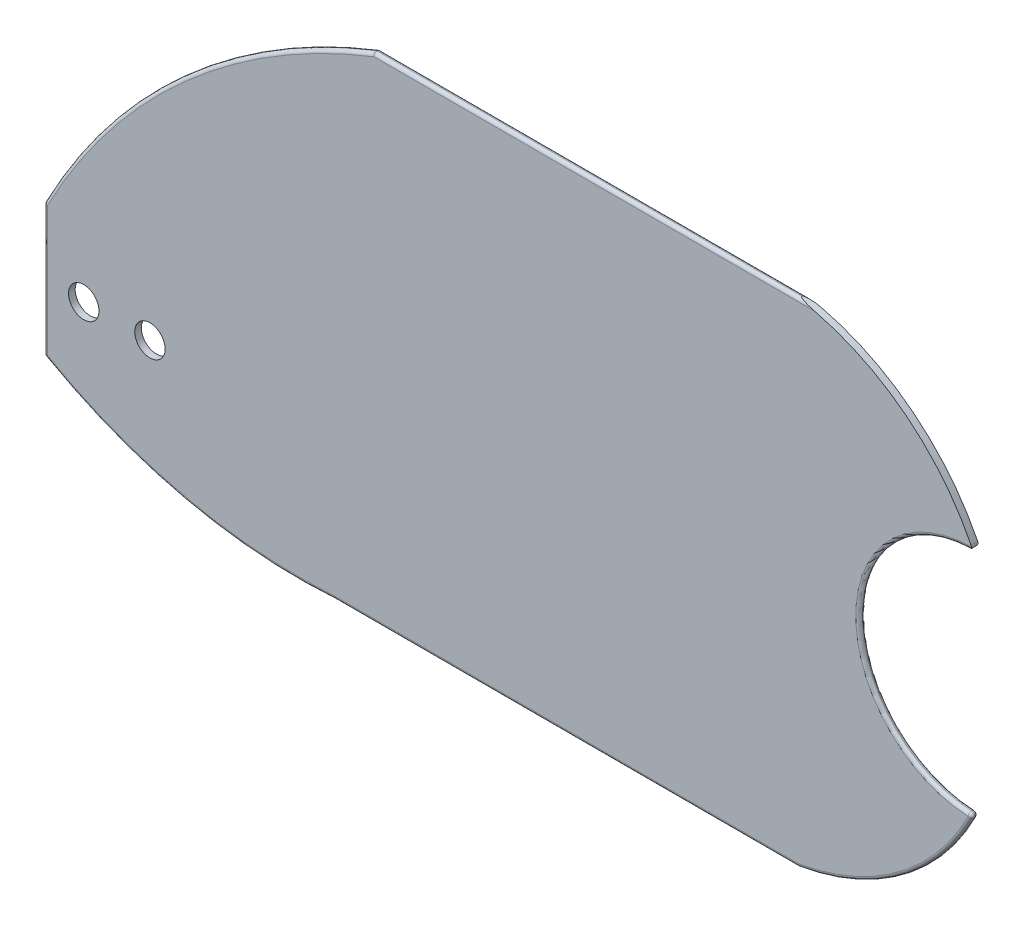
ISO-10303-21;
HEADER;
FILE_DESCRIPTION(('STEP AP214'),'2;1');
FILE_NAME('part.step','',(''),(''),'','','');
FILE_SCHEMA(('AUTOMOTIVE_DESIGN { 1 0 10303 214 1 1 1 1 }'));
ENDSEC;
DATA;
#1=APPLICATION_CONTEXT('core data for automotive mechanical design processes');
#2=APPLICATION_PROTOCOL_DEFINITION('international standard','automotive_design',2000,#1);
#3=PRODUCT_CONTEXT('',#1,'mechanical');
#4=PRODUCT('Part','Part','',(#3));
#5=PRODUCT_RELATED_PRODUCT_CATEGORY('part','',(#4));
#6=PRODUCT_DEFINITION_FORMATION('','',#4);
#7=PRODUCT_DEFINITION_CONTEXT('part definition',#1,'design');
#8=PRODUCT_DEFINITION('design','',#6,#7);
#9=PRODUCT_DEFINITION_SHAPE('','',#8);
#10=(LENGTH_UNIT() NAMED_UNIT(*) SI_UNIT(.MILLI.,.METRE.));
#11=(NAMED_UNIT(*) PLANE_ANGLE_UNIT() SI_UNIT($,.RADIAN.));
#12=(NAMED_UNIT(*) SI_UNIT($,.STERADIAN.) SOLID_ANGLE_UNIT());
#13=UNCERTAINTY_MEASURE_WITH_UNIT(LENGTH_MEASURE(1.E-05),#10,'distance_accuracy_value','');
#14=(GEOMETRIC_REPRESENTATION_CONTEXT(3) GLOBAL_UNCERTAINTY_ASSIGNED_CONTEXT((#13)) GLOBAL_UNIT_ASSIGNED_CONTEXT((#10,
#11,#12)) REPRESENTATION_CONTEXT('',''));
#15=CARTESIAN_POINT('',(0.,0.,0.));
#16=DIRECTION('',(0.,0.,1.));
#17=DIRECTION('',(1.,0.,0.));
#18=AXIS2_PLACEMENT_3D('',#15,#16,#17);
#19=CARTESIAN_POINT('',(385.634627392656,55.1747110336501,0.5));
#20=DIRECTION('',(0.,0.,-1.));
#21=DIRECTION('',(-1.,0.,0.));
#22=AXIS2_PLACEMENT_3D('',#19,#20,#21);
#23=CYLINDRICAL_SURFACE('',#22,17.9547618473941);
#24=DIRECTION('',(0.,0.,-1.));
#25=VECTOR('',#24,1.);
#26=CARTESIAN_POINT('',(388.656714197244,72.8733116659648,0.5));
#27=LINE('',#26,#25);
#28=CARTESIAN_POINT('',(388.656714197244,72.8733116659648,0.207920817465054));
#29=VERTEX_POINT('',#28);
#30=CARTESIAN_POINT('',(388.656714197244,72.8733116659648,0.292079182534946));
#31=VERTEX_POINT('',#30);
#32=EDGE_CURVE('E233',#29,#31,#27,.F.);
#33=ORIENTED_EDGE('',*,*,#32,.T.);
#34=CARTESIAN_POINT('',(388.656714197244,72.8733116659648,0.292079182534946));
#35=CARTESIAN_POINT('',(388.66305889166,72.8722285705896,0.298301009718315));
#36=CARTESIAN_POINT('',(388.669910667787,72.8710548469745,0.303879054300855));
#37=CARTESIAN_POINT('',(388.684225081437,72.8685934937381,0.31405916971495));
#38=CARTESIAN_POINT('',(388.691683133368,72.8673067141445,0.318667765769108));
#39=CARTESIAN_POINT('',(388.714373271092,72.8633761726897,0.331531594027607));
#40=CARTESIAN_POINT('',(388.730052555621,72.8606398624957,0.338927635021274));
#41=CARTESIAN_POINT('',(388.776533677661,72.8524614139527,0.358683280167489));
#42=CARTESIAN_POINT('',(388.807986912445,72.8468442988038,0.369355397219936));
#43=CARTESIAN_POINT('',(388.871499534821,72.8353221007642,0.388453139348926));
#44=CARTESIAN_POINT('',(388.903559622815,72.829416670916,0.396875974686664));
#45=CARTESIAN_POINT('',(388.968814105436,72.8172108497391,0.41240179188037));
#46=CARTESIAN_POINT('',(389.002016625942,72.8109042360243,0.419465809643193));
#47=CARTESIAN_POINT('',(389.068571812218,72.7980662193,0.432419534901773));
#48=CARTESIAN_POINT('',(389.101924339505,72.7915349968208,0.438310160792338));
#49=CARTESIAN_POINT('',(389.196778837683,72.7726788780151,0.453697263174428));
#50=CARTESIAN_POINT('',(389.258411996105,72.7600921606503,0.462070560450383));
#51=CARTESIAN_POINT('',(389.381848443034,72.7342038947969,0.476268221932934));
#52=CARTESIAN_POINT('',(389.443651808669,72.7209019416981,0.482091125976721));
#53=CARTESIAN_POINT('',(389.563458900248,72.6944507887267,0.491076325943153));
#54=CARTESIAN_POINT('',(389.62146106379,72.681343083367,0.494380979091129));
#55=CARTESIAN_POINT('',(389.737356898725,72.6545457901399,0.498827230332581));
#56=CARTESIAN_POINT('',(389.795250620844,72.6408567509479,0.499970823644616));
#57=CARTESIAN_POINT('',(389.853078097709,72.6268784247127,0.5));
#58=B_SPLINE_CURVE_WITH_KNOTS('',3,(#34,#35,#36,#37,#38,#39,#40,#41,#42,#43,#44,#45,#46,#47,#48,
#49,#50,#51,#52,#53,#54,#55,#56,#57),.UNSPECIFIED.,.F.,.F.,(4,2,2,2,2,2,2,2,2,2,2,4),(0.,
0.0267086886978148,0.0532314059923864,0.105779829641452,0.206636044052154,0.30761677345847,
0.411162744932395,0.51462735143285,0.704930930098681,0.895343320273792,1.0739714726051,
1.2524346241074),.UNSPECIFIED.);
#59=CARTESIAN_POINT('',(389.85307809771,72.6268784247127,0.5));
#60=VERTEX_POINT('',#59);
#61=EDGE_CURVE('E146',#31,#60,#58,.T.);
#62=ORIENTED_EDGE('',*,*,#61,.T.);
#63=CARTESIAN_POINT('',(385.634627392656,55.1747110336501,0.5));
#64=DIRECTION('',(0.,0.,1.));
#65=DIRECTION('',(-1.,0.,0.));
#66=AXIS2_PLACEMENT_3D('',#63,#64,#65);
#67=CIRCLE('',#66,17.9547618473941);
#68=CARTESIAN_POINT('',(401.680832858693,63.2303154888325,0.5));
#69=VERTEX_POINT('',#68);
#70=EDGE_CURVE('E134',#69,#60,#67,.T.);
#71=ORIENTED_EDGE('',*,*,#70,.F.);
#72=DIRECTION('',(0.,0.,-1.));
#73=VECTOR('',#72,1.);
#74=CARTESIAN_POINT('',(401.680832858693,63.2303154888325,0.5));
#75=LINE('',#74,#73);
#76=CARTESIAN_POINT('',(401.680832858693,63.2303154888325,0.));
#77=VERTEX_POINT('',#76);
#78=EDGE_CURVE('E491',#69,#77,#75,.T.);
#79=ORIENTED_EDGE('',*,*,#78,.T.);
#80=CARTESIAN_POINT('',(385.634627392656,55.1747110336501,0.));
#81=DIRECTION('',(0.,0.,1.));
#82=DIRECTION('',(-1.,0.,0.));
#83=AXIS2_PLACEMENT_3D('',#80,#81,#82);
#84=CIRCLE('',#83,17.9547618473941);
#85=CARTESIAN_POINT('',(389.853078097736,72.6268784247063,0.));
#86=VERTEX_POINT('',#85);
#87=EDGE_CURVE('E319',#77,#86,#84,.T.);
#88=ORIENTED_EDGE('',*,*,#87,.T.);
#89=CARTESIAN_POINT('',(389.853078097736,72.6268784247063,0.));
#90=CARTESIAN_POINT('',(389.812579281476,72.6366677301254,7.06866289226677E-06));
#91=CARTESIAN_POINT('',(389.772047791003,72.6463154643308,0.000575013800822301));
#92=CARTESIAN_POINT('',(389.690944338623,72.6653227844248,0.00278654236941547));
#93=CARTESIAN_POINT('',(389.650372374856,72.6746823563586,0.00443017780705801));
#94=CARTESIAN_POINT('',(389.569060850463,72.6931427982752,0.00875525652909985));
#95=CARTESIAN_POINT('',(389.528321244898,72.7022425359731,0.0114406634166451));
#96=CARTESIAN_POINT('',(389.446859178822,72.7201406558444,0.0178522547371958));
#97=CARTESIAN_POINT('',(389.406136717729,72.7289390491975,0.0215784005120782));
#98=CARTESIAN_POINT('',(389.30222412684,72.751012806056,0.0324793758958459));
#99=CARTESIAN_POINT('',(389.239067835834,72.7640721040559,0.0404216847629922));
#100=CARTESIAN_POINT('',(389.113173735107,72.7894007279071,0.0593654884491475));
#101=CARTESIAN_POINT('',(389.050435307951,72.801671741374,0.0703601601775139));
#102=CARTESIAN_POINT('',(388.953319872109,72.8201357410452,0.0911053444280598));
#103=CARTESIAN_POINT('',(388.918654614807,72.8266195432856,0.099260731730429));
#104=CARTESIAN_POINT('',(388.849630585379,72.8393212594987,0.117711986614508));
#105=CARTESIAN_POINT('',(388.815273727327,72.8455379341509,0.128016753455523));
#106=CARTESIAN_POINT('',(388.764124036467,72.8546443821411,0.146700985837683));
#107=CARTESIAN_POINT('',(388.746826828425,72.8576969412273,0.153624936486984));
#108=CARTESIAN_POINT('',(388.713083417581,72.8636020498923,0.169162577522634));
#109=CARTESIAN_POINT('',(388.696630493833,72.8664562779954,0.177758892118281));
#110=CARTESIAN_POINT('',(388.676943402784,72.8698461407705,0.191048661644153));
#111=CARTESIAN_POINT('',(388.672684390248,72.8705777799385,0.194125471744911));
#112=CARTESIAN_POINT('',(388.664447533248,72.8719899376794,0.200689292039214));
#113=CARTESIAN_POINT('',(388.660471495028,72.8726701293355,0.204178614288748));
#114=CARTESIAN_POINT('',(388.656714197244,72.8733116659648,0.207920817465087));
#115=B_SPLINE_CURVE_WITH_KNOTS('',3,(#89,#90,#91,#92,#93,#94,#95,#96,#97,#98,#99,#100,#101,#102,
#103,#104,#105,#106,#107,#108,#109,#110,#111,#112,#113,#114),.UNSPECIFIED.,.F.,.F.,(4,2,2,2,2,2,
2,2,2,2,2,2,4),(0.,0.124989311832432,0.249984667037033,0.37546032841032,0.500931329624656,
0.695816491266512,0.890269476733475,0.998841256501074,1.10787182063757,1.16449331742446,
1.22055523000083,1.23644921912819,1.25243693939884),.UNSPECIFIED.);
#116=EDGE_CURVE('E225',#86,#29,#115,.T.);
#117=ORIENTED_EDGE('',*,*,#116,.T.);
#118=EDGE_LOOP('',(#33,#62,#71,#79,#88,#117));
#119=FACE_BOUND('',#118,.T.);
#120=ADVANCED_FACE('F38',(#119),#23,.T.);
#121=CARTESIAN_POINT('',(373.724484528975,28.6130007129667,0.5));
#122=DIRECTION('',(0.,0.,-1.));
#123=DIRECTION('',(-1.,0.,0.));
#124=AXIS2_PLACEMENT_3D('',#121,#122,#123);
#125=PLANE('',#124);
#126=CARTESIAN_POINT('',(334.636443484266,45.6034672727585,0.5));
#127=DIRECTION('',(0.,0.,-1.));
#128=DIRECTION('',(-1.,0.,0.));
#129=AXIS2_PLACEMENT_3D('',#126,#127,#128);
#130=CIRCLE('',#129,1.14999999999996);
#131=CARTESIAN_POINT('',(333.486443484266,45.6034672727585,0.5));
#132=VERTEX_POINT('',#131);
#133=EDGE_CURVE('E312',#132,#132,#130,.F.);
#134=ORIENTED_EDGE('',*,*,#133,.F.);
#135=EDGE_LOOP('',(#134));
#136=FACE_BOUND('',#135,.T.);
#137=CARTESIAN_POINT('',(339.636443484266,45.6034672727585,0.5));
#138=DIRECTION('',(0.,0.,-1.));
#139=DIRECTION('',(-1.,0.,0.));
#140=AXIS2_PLACEMENT_3D('',#137,#138,#139);
#141=CIRCLE('',#140,1.14999999999996);
#142=CARTESIAN_POINT('',(338.486443484266,45.6034672727585,0.5));
#143=VERTEX_POINT('',#142);
#144=EDGE_CURVE('E313',#143,#143,#141,.F.);
#145=ORIENTED_EDGE('',*,*,#144,.F.);
#146=EDGE_LOOP('',(#145));
#147=FACE_BOUND('',#146,.T.);
#148=ORIENTED_EDGE('',*,*,#70,.T.);
#149=DIRECTION('',(-1.,0.,0.));
#150=VECTOR('',#149,1.);
#151=CARTESIAN_POINT('',(373.724484528975,72.6268784247063,0.5));
#152=LINE('',#151,#150);
#153=CARTESIAN_POINT('',(356.575678380357,72.6268784247063,0.5));
#154=VERTEX_POINT('',#153);
#155=EDGE_CURVE('E126',#60,#154,#152,.T.);
#156=ORIENTED_EDGE('',*,*,#155,.T.);
#157=CARTESIAN_POINT('',(373.724484528975,28.6130007129667,0.5));
#158=DIRECTION('',(0.,0.,-1.));
#159=DIRECTION('',(-1.,0.,0.));
#160=AXIS2_PLACEMENT_3D('',#157,#158,#159);
#161=CIRCLE('',#160,47.2366699032313);
#162=CARTESIAN_POINT('',(331.886443484266,50.5420067344,0.5));
#163=VERTEX_POINT('',#162);
#164=EDGE_CURVE('E130',#154,#163,#161,.F.);
#165=ORIENTED_EDGE('',*,*,#164,.T.);
#166=DIRECTION('',(0.,-1.,0.));
#167=VECTOR('',#166,1.);
#168=CARTESIAN_POINT('',(331.886443484266,28.6130007129667,0.5));
#169=LINE('',#168,#167);
#170=CARTESIAN_POINT('',(331.886443484266,40.7488215984856,0.5));
#171=VERTEX_POINT('',#170);
#172=EDGE_CURVE('E300',#163,#171,#169,.T.);
#173=ORIENTED_EDGE('',*,*,#172,.T.);
#174=CARTESIAN_POINT('',(350.836644719428,74.1847404462408,0.5));
#175=DIRECTION('',(0.,0.,-1.));
#176=DIRECTION('',(-1.,0.,0.));
#177=AXIS2_PLACEMENT_3D('',#174,#175,#176);
#178=CIRCLE('',#177,38.4326787519013);
#179=CARTESIAN_POINT('',(353.608729154789,35.8521649531947,0.5));
#180=VERTEX_POINT('',#179);
#181=EDGE_CURVE('E302',#171,#180,#178,.F.);
#182=ORIENTED_EDGE('',*,*,#181,.T.);
#183=CARTESIAN_POINT('',(353.644793313278,35.3534672727585,0.5));
#184=DIRECTION('',(0.,0.,-1.));
#185=DIRECTION('',(-1.,0.,0.));
#186=AXIS2_PLACEMENT_3D('',#183,#184,#185);
#187=CIRCLE('',#186,0.5);
#188=CARTESIAN_POINT('',(353.644793313278,35.8534672727585,0.5));
#189=VERTEX_POINT('',#188);
#190=EDGE_CURVE('E305',#189,#180,#187,.F.);
#191=ORIENTED_EDGE('',*,*,#190,.F.);
#192=DIRECTION('',(1.,0.,0.));
#193=VECTOR('',#192,1.);
#194=CARTESIAN_POINT('',(373.724484528975,35.8534672727585,0.5));
#195=LINE('',#194,#193);
#196=CARTESIAN_POINT('',(388.614635014709,35.8534672727585,0.5));
#197=VERTEX_POINT('',#196);
#198=EDGE_CURVE('E297',#189,#197,#195,.T.);
#199=ORIENTED_EDGE('',*,*,#198,.T.);
#200=CARTESIAN_POINT('',(385.634627392656,53.3056346638146,0.5));
#201=DIRECTION('',(0.,0.,-1.));
#202=DIRECTION('',(-1.,0.,0.));
#203=AXIS2_PLACEMENT_3D('',#200,#201,#202);
#204=CIRCLE('',#203,17.7047618473941);
#205=CARTESIAN_POINT('',(401.4574073741,45.3621955010996,0.5));
#206=VERTEX_POINT('',#205);
#207=EDGE_CURVE('E493',#197,#206,#204,.F.);
#208=ORIENTED_EDGE('',*,*,#207,.T.);
#209=CARTESIAN_POINT('',(401.85339950768,54.2401728487324,0.5));
#210=DIRECTION('',(0.,0.,-1.));
#211=DIRECTION('',(-1.,0.,0.));
#212=AXIS2_PLACEMENT_3D('',#209,#210,#211);
#213=CIRCLE('',#212,8.88680434998636);
#214=CARTESIAN_POINT('',(401.707291040397,63.1257760286366,0.5));
#215=VERTEX_POINT('',#214);
#216=EDGE_CURVE('E487',#206,#215,#213,.T.);
#217=ORIENTED_EDGE('',*,*,#216,.T.);
#218=CARTESIAN_POINT('',(401.4574073741,63.1181501963651,0.5));
#219=DIRECTION('',(0.,0.,-1.));
#220=DIRECTION('',(-1.,0.,0.));
#221=AXIS2_PLACEMENT_3D('',#218,#219,#220);
#222=CIRCLE('',#221,0.25);
#223=EDGE_CURVE('E485',#215,#69,#222,.F.);
#224=ORIENTED_EDGE('',*,*,#223,.T.);
#225=EDGE_LOOP('',(#148,#156,#165,#173,#182,#191,#199,#208,#217,#224));
#226=FACE_BOUND('',#225,.T.);
#227=ADVANCED_FACE('F128',(#136,#147,#226),#125,.F.);
#228=CARTESIAN_POINT('',(373.724484528975,28.6130007129667,0.));
#229=DIRECTION('',(0.,0.,-1.));
#230=DIRECTION('',(-1.,0.,0.));
#231=AXIS2_PLACEMENT_3D('',#228,#229,#230);
#232=PLANE('',#231);
#233=CARTESIAN_POINT('',(373.724484528975,28.6130007129667,0.));
#234=DIRECTION('',(0.,0.,-1.));
#235=DIRECTION('',(-1.,0.,0.));
#236=AXIS2_PLACEMENT_3D('',#233,#234,#235);
#237=CIRCLE('',#236,47.2366699032313);
#238=CARTESIAN_POINT('',(331.886443484266,50.5420067344,0.));
#239=VERTEX_POINT('',#238);
#240=CARTESIAN_POINT('',(356.575678380357,72.6268784247063,0.));
#241=VERTEX_POINT('',#240);
#242=EDGE_CURVE('E57',#239,#241,#237,.T.);
#243=ORIENTED_EDGE('',*,*,#242,.T.);
#244=DIRECTION('',(-1.,0.,0.));
#245=VECTOR('',#244,1.);
#246=CARTESIAN_POINT('',(388.6357509582,72.6268784247063,0.));
#247=LINE('',#246,#245);
#248=EDGE_CURVE('E427',#241,#86,#247,.F.);
#249=ORIENTED_EDGE('',*,*,#248,.T.);
#250=ORIENTED_EDGE('',*,*,#87,.F.);
#251=CARTESIAN_POINT('',(401.4574073741,63.1181501963651,0.));
#252=DIRECTION('',(0.,0.,-1.));
#253=DIRECTION('',(-1.,0.,0.));
#254=AXIS2_PLACEMENT_3D('',#251,#252,#253);
#255=CIRCLE('',#254,0.25);
#256=CARTESIAN_POINT('',(401.707291040397,63.1257760286366,0.));
#257=VERTEX_POINT('',#256);
#258=EDGE_CURVE('E308',#77,#257,#255,.T.);
#259=ORIENTED_EDGE('',*,*,#258,.T.);
#260=CARTESIAN_POINT('',(401.85339950768,54.2401728487324,0.));
#261=DIRECTION('',(0.,0.,-1.));
#262=DIRECTION('',(-1.,0.,0.));
#263=AXIS2_PLACEMENT_3D('',#260,#261,#262);
#264=CIRCLE('',#263,8.88680434998636);
#265=CARTESIAN_POINT('',(401.4574073741,45.3621955010996,0.));
#266=VERTEX_POINT('',#265);
#267=EDGE_CURVE('E497',#257,#266,#264,.F.);
#268=ORIENTED_EDGE('',*,*,#267,.T.);
#269=CARTESIAN_POINT('',(385.634627392656,53.3056346638146,0.));
#270=DIRECTION('',(0.,0.,-1.));
#271=DIRECTION('',(-1.,0.,0.));
#272=AXIS2_PLACEMENT_3D('',#269,#270,#271);
#273=CIRCLE('',#272,17.7047618473941);
#274=CARTESIAN_POINT('',(388.614635014709,35.8534672727585,0.));
#275=VERTEX_POINT('',#274);
#276=EDGE_CURVE('E454',#266,#275,#273,.T.);
#277=ORIENTED_EDGE('',*,*,#276,.T.);
#278=DIRECTION('',(1.,0.,0.));
#279=VECTOR('',#278,1.);
#280=CARTESIAN_POINT('',(353.6357509582,35.8534672727585,0.));
#281=LINE('',#280,#279);
#282=CARTESIAN_POINT('',(353.644793313278,35.8534672727585,0.));
#283=VERTEX_POINT('',#282);
#284=EDGE_CURVE('E183',#275,#283,#281,.F.);
#285=ORIENTED_EDGE('',*,*,#284,.T.);
#286=CARTESIAN_POINT('',(353.644793313278,35.3534672727585,0.));
#287=DIRECTION('',(0.,0.,-1.));
#288=DIRECTION('',(-1.,0.,0.));
#289=AXIS2_PLACEMENT_3D('',#286,#287,#288);
#290=CIRCLE('',#289,0.5);
#291=CARTESIAN_POINT('',(353.608729154789,35.8521649531947,0.));
#292=VERTEX_POINT('',#291);
#293=EDGE_CURVE('E286',#292,#283,#290,.T.);
#294=ORIENTED_EDGE('',*,*,#293,.F.);
#295=CARTESIAN_POINT('',(350.836644719428,74.1847404462408,0.));
#296=DIRECTION('',(0.,0.,-1.));
#297=DIRECTION('',(-1.,0.,0.));
#298=AXIS2_PLACEMENT_3D('',#295,#296,#297);
#299=CIRCLE('',#298,38.4326787519013);
#300=CARTESIAN_POINT('',(331.886443484266,40.7488215984856,0.));
#301=VERTEX_POINT('',#300);
#302=EDGE_CURVE('E285',#292,#301,#299,.T.);
#303=ORIENTED_EDGE('',*,*,#302,.T.);
#304=DIRECTION('',(0.,-1.,0.));
#305=VECTOR('',#304,1.);
#306=CARTESIAN_POINT('',(331.886443484266,50.6034672727585,0.));
#307=LINE('',#306,#305);
#308=EDGE_CURVE('E280',#301,#239,#307,.F.);
#309=ORIENTED_EDGE('',*,*,#308,.T.);
#310=EDGE_LOOP('',(#243,#249,#250,#259,#268,#277,#285,#294,#303,#309));
#311=FACE_BOUND('',#310,.T.);
#312=CARTESIAN_POINT('',(334.636443484266,45.6034672727585,0.));
#313=DIRECTION('',(0.,0.,-1.));
#314=DIRECTION('',(-1.,0.,0.));
#315=AXIS2_PLACEMENT_3D('',#312,#313,#314);
#316=CIRCLE('',#315,1.14999999999996);
#317=CARTESIAN_POINT('',(333.486443484266,45.6034672727585,0.));
#318=VERTEX_POINT('',#317);
#319=EDGE_CURVE('E309',#318,#318,#316,.F.);
#320=ORIENTED_EDGE('',*,*,#319,.T.);
#321=EDGE_LOOP('',(#320));
#322=FACE_BOUND('',#321,.T.);
#323=CARTESIAN_POINT('',(339.636443484266,45.6034672727585,0.));
#324=DIRECTION('',(0.,0.,-1.));
#325=DIRECTION('',(-1.,0.,0.));
#326=AXIS2_PLACEMENT_3D('',#323,#324,#325);
#327=CIRCLE('',#326,1.14999999999996);
#328=CARTESIAN_POINT('',(338.486443484266,45.6034672727585,0.));
#329=VERTEX_POINT('',#328);
#330=EDGE_CURVE('E224',#329,#329,#327,.F.);
#331=ORIENTED_EDGE('',*,*,#330,.T.);
#332=EDGE_LOOP('',(#331));
#333=FACE_BOUND('',#332,.T.);
#334=ADVANCED_FACE('F244',(#311,#322,#333),#232,.T.);
#335=CARTESIAN_POINT('',(385.634627392656,53.3056346638146,0.25));
#336=DIRECTION('',(0.,0.,-1.));
#337=DIRECTION('',(-1.,0.,0.));
#338=AXIS2_PLACEMENT_3D('',#335,#336,#337);
#339=TOROIDAL_SURFACE('',#338,17.7047618473941,0.25);
#340=CARTESIAN_POINT('',(385.634627392656,53.3056346638146,0.25));
#341=DIRECTION('',(0.,0.,-1.));
#342=DIRECTION('',(-1.,0.,0.));
#343=AXIS2_PLACEMENT_3D('',#340,#341,#342);
#344=CIRCLE('',#343,17.9547618473941);
#345=CARTESIAN_POINT('',(388.656714197244,35.6070340314999,0.25));
#346=VERTEX_POINT('',#345);
#347=CARTESIAN_POINT('',(401.680832858693,45.2500302086323,0.25));
#348=VERTEX_POINT('',#347);
#349=EDGE_CURVE('E323',#346,#348,#344,.F.);
#350=ORIENTED_EDGE('',*,*,#349,.F.);
#351=CARTESIAN_POINT('',(388.614635014709,35.8534672727585,0.25));
#352=DIRECTION('',(-0.985732965034201,-0.168316730139586,0.));
#353=DIRECTION('',(0.168316730139586,-0.985732965034201,0.));
#354=AXIS2_PLACEMENT_3D('',#351,#352,#353);
#355=CIRCLE('',#354,0.25);
#356=EDGE_CURVE('E289',#346,#275,#355,.F.);
#357=ORIENTED_EDGE('',*,*,#356,.T.);
#358=ORIENTED_EDGE('',*,*,#276,.F.);
#359=CARTESIAN_POINT('',(401.4574073741,45.3621955010997,0.25));
#360=DIRECTION('',(0.448661169869618,0.893701938372758,-2.73259274307276E-13));
#361=DIRECTION('',(-0.893701938372758,0.448661169869618,0.));
#362=AXIS2_PLACEMENT_3D('',#359,#360,#361);
#363=CIRCLE('',#362,0.25);
#364=EDGE_CURVE('E316',#348,#266,#363,.T.);
#365=ORIENTED_EDGE('',*,*,#364,.F.);
#366=EDGE_LOOP('',(#350,#357,#358,#365));
#367=FACE_BOUND('',#366,.T.);
#368=ADVANCED_FACE('F360',(#367),#339,.T.);
#369=CARTESIAN_POINT('',(401.4574073741,45.3621955010997,0.25));
#370=DIRECTION('',(0.,0.,1.));
#371=DIRECTION('',(1.,0.,0.));
#372=AXIS2_PLACEMENT_3D('',#369,#370,#371);
#373=SPHERICAL_SURFACE('',#372,0.25);
#374=CARTESIAN_POINT('',(401.4574073741,45.3621955010997,0.25));
#375=DIRECTION('',(0.,0.,-1.));
#376=DIRECTION('',(-1.,0.,0.));
#377=AXIS2_PLACEMENT_3D('',#374,#375,#376);
#378=CIRCLE('',#377,0.25);
#379=CARTESIAN_POINT('',(401.46854726528,45.6119471834254,0.25));
#380=VERTEX_POINT('',#379);
#381=EDGE_CURVE('E320',#348,#380,#378,.F.);
#382=ORIENTED_EDGE('',*,*,#381,.F.);
#383=ORIENTED_EDGE('',*,*,#364,.T.);
#384=CARTESIAN_POINT('',(401.4574073741,45.3621955010997,0.25));
#385=DIRECTION('',(0.999006729302661,-0.0445595647196035,0.));
#386=DIRECTION('',(0.0445595647196035,0.999006729302661,0.));
#387=AXIS2_PLACEMENT_3D('',#384,#385,#386);
#388=CIRCLE('',#387,0.25);
#389=EDGE_CURVE('E326',#380,#266,#388,.F.);
#390=ORIENTED_EDGE('',*,*,#389,.F.);
#391=EDGE_LOOP('',(#382,#383,#390));
#392=FACE_BOUND('',#391,.T.);
#393=ADVANCED_FACE('F356',(#392),#373,.T.);
#394=CARTESIAN_POINT('',(385.634627392656,53.3056346638146,0.25));
#395=DIRECTION('',(0.,0.,-1.));
#396=DIRECTION('',(-1.,0.,0.));
#397=AXIS2_PLACEMENT_3D('',#394,#395,#396);
#398=TOROIDAL_SURFACE('',#397,17.7047618473941,0.25);
#399=ORIENTED_EDGE('',*,*,#207,.F.);
#400=CARTESIAN_POINT('',(388.614635014709,35.8534672727585,0.25));
#401=DIRECTION('',(-0.985732965034201,-0.168316730139586,0.));
#402=DIRECTION('',(0.168316730139586,-0.985732965034201,0.));
#403=AXIS2_PLACEMENT_3D('',#400,#401,#402);
#404=CIRCLE('',#403,0.25);
#405=EDGE_CURVE('E294',#197,#346,#404,.F.);
#406=ORIENTED_EDGE('',*,*,#405,.T.);
#407=ORIENTED_EDGE('',*,*,#349,.T.);
#408=CARTESIAN_POINT('',(401.4574073741,45.3621955010996,0.25));
#409=DIRECTION('',(0.448661169869374,0.893701938372881,0.));
#410=DIRECTION('',(-0.893701938372881,0.448661169869374,0.));
#411=AXIS2_PLACEMENT_3D('',#408,#409,#410);
#412=CIRCLE('',#411,0.25);
#413=EDGE_CURVE('E329',#206,#348,#412,.T.);
#414=ORIENTED_EDGE('',*,*,#413,.F.);
#415=EDGE_LOOP('',(#399,#406,#407,#414));
#416=FACE_BOUND('',#415,.T.);
#417=ADVANCED_FACE('F347',(#416),#398,.T.);
#418=CARTESIAN_POINT('',(401.85339950768,54.2401728487324,0.25));
#419=DIRECTION('',(0.,0.,-1.));
#420=DIRECTION('',(-1.,0.,0.));
#421=AXIS2_PLACEMENT_3D('',#418,#419,#420);
#422=TOROIDAL_SURFACE('',#421,8.88680434998636,0.25);
#423=ORIENTED_EDGE('',*,*,#389,.T.);
#424=ORIENTED_EDGE('',*,*,#267,.F.);
#425=CARTESIAN_POINT('',(401.707291040397,63.1257760286366,0.));
#426=CARTESIAN_POINT('',(401.707651321128,63.1145942639288,-1.93568525922414E-05));
#427=CARTESIAN_POINT('',(401.707223431689,63.1034158455636,0.000749421407648142));
#428=CARTESIAN_POINT('',(401.704943171162,63.0814920588074,0.00370527225283598));
#429=CARTESIAN_POINT('',(401.70310314809,63.0707437818967,0.0058800248353799));
#430=CARTESIAN_POINT('',(401.698158202203,63.0499291955711,0.0114872619567685));
#431=CARTESIAN_POINT('',(401.695056601861,63.0398611752418,0.0149164404878666));
#432=CARTESIAN_POINT('',(401.687795399886,63.0205383074835,0.0228250930393641));
#433=CARTESIAN_POINT('',(401.683633455247,63.0112853227476,0.0273068912615387));
#434=CARTESIAN_POINT('',(401.672583242522,62.9901092568826,0.0391157525216701));
#435=CARTESIAN_POINT('',(401.665275421167,62.978636866653,0.0468576585828223));
#436=CARTESIAN_POINT('',(401.649449410073,62.957543670102,0.0635291133574368));
#437=CARTESIAN_POINT('',(401.640928845975,62.9479265852994,0.0724609895983543));
#438=CARTESIAN_POINT('',(401.619464018319,62.9269866620733,0.0948802387786373));
#439=CARTESIAN_POINT('',(401.606110007074,62.9165113252332,0.10876456233494));
#440=CARTESIAN_POINT('',(401.578377103732,62.8987465306967,0.137491639108863));
#441=CARTESIAN_POINT('',(401.563997073047,62.8914606784322,0.152335455315861));
#442=CARTESIAN_POINT('',(401.536544458156,62.8806093251985,0.18057621354211));
#443=CARTESIAN_POINT('',(401.523545643252,62.8766827741657,0.193909679377058));
#444=CARTESIAN_POINT('',(401.497299177191,62.8709893090004,0.220747265586993));
#445=CARTESIAN_POINT('',(401.484052067822,62.8692181475291,0.234250997184098));
#446=CARTESIAN_POINT('',(401.470025662043,62.8684677499714,0.248498719213326));
#447=CARTESIAN_POINT('',(401.46928651765,62.8684314931215,0.249249378976631));
#448=CARTESIAN_POINT('',(401.46854726528,62.8683985140394,0.25));
#449=B_SPLINE_CURVE_WITH_KNOTS('',3,(#425,#426,#427,#428,#429,#430,#431,#432,#433,#434,#435,
#436,#437,#438,#439,#440,#441,#442,#443,#444,#445,#446,#447,#448),.UNSPECIFIED.,.F.,.F.,(4,2,2,
2,2,2,2,2,2,2,2,4),(0.,0.0334663295230579,0.066643310073983,0.0997334761650932,
0.132897404418241,0.179590865568874,0.226377035908174,0.291807728280051,0.357312194496257,
0.414281855028051,0.471139070302804,0.474301363327024),.UNSPECIFIED.);
#450=CARTESIAN_POINT('',(401.46854726528,62.8683985140394,0.25));
#451=VERTEX_POINT('',#450);
#452=EDGE_CURVE('E332',#451,#257,#449,.F.);
#453=ORIENTED_EDGE('',*,*,#452,.F.);
#454=CARTESIAN_POINT('',(401.85339950768,54.2401728487324,0.25));
#455=DIRECTION('',(0.,0.,-1.));
#456=DIRECTION('',(-1.,0.,0.));
#457=AXIS2_PLACEMENT_3D('',#454,#455,#456);
#458=CIRCLE('',#457,8.63680434998636);
#459=EDGE_CURVE('E340',#380,#451,#458,.T.);
#460=ORIENTED_EDGE('',*,*,#459,.F.);
#461=EDGE_LOOP('',(#423,#424,#453,#460));
#462=FACE_BOUND('',#461,.T.);
#463=ADVANCED_FACE('F342',(#462),#422,.T.);
#464=CARTESIAN_POINT('',(401.4574073741,45.3621955010997,0.25));
#465=DIRECTION('',(0.,0.,1.));
#466=DIRECTION('',(1.,0.,0.));
#467=AXIS2_PLACEMENT_3D('',#464,#465,#466);
#468=SPHERICAL_SURFACE('',#467,0.25);
#469=ORIENTED_EDGE('',*,*,#413,.T.);
#470=ORIENTED_EDGE('',*,*,#381,.T.);
#471=CARTESIAN_POINT('',(401.4574073741,45.3621955010997,0.25));
#472=DIRECTION('',(0.999006729302681,-0.0445595647191603,4.43648109050923E-13));
#473=DIRECTION('',(0.0445595647191603,0.999006729302681,0.));
#474=AXIS2_PLACEMENT_3D('',#471,#472,#473);
#475=CIRCLE('',#474,0.25);
#476=EDGE_CURVE('E508',#206,#380,#475,.F.);
#477=ORIENTED_EDGE('',*,*,#476,.F.);
#478=EDGE_LOOP('',(#469,#470,#477));
#479=FACE_BOUND('',#478,.T.);
#480=ADVANCED_FACE('F346',(#479),#468,.T.);
#481=CARTESIAN_POINT('',(401.4574073741,63.1181501963651,0.5));
#482=DIRECTION('',(0.,0.,1.));
#483=DIRECTION('',(1.,0.,0.));
#484=AXIS2_PLACEMENT_3D('',#481,#482,#483);
#485=CYLINDRICAL_SURFACE('',#484,0.25);
#486=ORIENTED_EDGE('',*,*,#78,.F.);
#487=ORIENTED_EDGE('',*,*,#223,.F.);
#488=CARTESIAN_POINT('',(401.707291040397,63.1257760286366,0.5));
#489=CARTESIAN_POINT('',(401.707651321128,63.1145942639288,0.500019356852592));
#490=CARTESIAN_POINT('',(401.707223431689,63.1034158455636,0.499250578592352));
#491=CARTESIAN_POINT('',(401.704943171162,63.0814920588074,0.496294727747164));
#492=CARTESIAN_POINT('',(401.70310314809,63.0707437818967,0.49411997516462));
#493=CARTESIAN_POINT('',(401.698158202203,63.0499291955711,0.488512738043231));
#494=CARTESIAN_POINT('',(401.695056601861,63.0398611752418,0.485083559512133));
#495=CARTESIAN_POINT('',(401.687795399886,63.0205383074835,0.477174906960636));
#496=CARTESIAN_POINT('',(401.683633455247,63.0112853227476,0.472693108738461));
#497=CARTESIAN_POINT('',(401.672583242522,62.9901092568826,0.46088424747833));
#498=CARTESIAN_POINT('',(401.665275421167,62.978636866653,0.453142341417178));
#499=CARTESIAN_POINT('',(401.649449410073,62.957543670102,0.436470886642563));
#500=CARTESIAN_POINT('',(401.640928845975,62.9479265852994,0.427539010401645));
#501=CARTESIAN_POINT('',(401.619464018319,62.9269866620733,0.405119761221366));
#502=CARTESIAN_POINT('',(401.606110007074,62.9165113252332,0.391235437665071));
#503=CARTESIAN_POINT('',(401.578377103732,62.8987465306967,0.362508360891135));
#504=CARTESIAN_POINT('',(401.563997073047,62.8914606784321,0.347664544684117));
#505=CARTESIAN_POINT('',(401.536544458156,62.8806093251985,0.319423786457863));
#506=CARTESIAN_POINT('',(401.523545643252,62.8766827741657,0.306090320622928));
#507=CARTESIAN_POINT('',(401.497299177191,62.8709893090004,0.279252734413014));
#508=CARTESIAN_POINT('',(401.484052067822,62.8692181475291,0.265749002815917));
#509=CARTESIAN_POINT('',(401.470025662043,62.8684677499714,0.251501280786677));
#510=CARTESIAN_POINT('',(401.46928651765,62.8684314931215,0.25075062102337));
#511=CARTESIAN_POINT('',(401.46854726528,62.8683985140394,0.25));
#512=B_SPLINE_CURVE_WITH_KNOTS('',3,(#488,#489,#490,#491,#492,#493,#494,#495,#496,#497,#498,
#499,#500,#501,#502,#503,#504,#505,#506,#507,#508,#509,#510,#511),.UNSPECIFIED.,.F.,.F.,(4,2,2,
2,2,2,2,2,2,2,2,4),(0.,0.0334663295230579,0.066643310073983,0.0997334761650932,
0.132897404418241,0.179590865568874,0.226377035908174,0.291807728280038,0.357312194496281,
0.414281855028051,0.471139070302801,0.474301363327024),.UNSPECIFIED.);
#513=EDGE_CURVE('E503',#451,#215,#512,.F.);
#514=ORIENTED_EDGE('',*,*,#513,.F.);
#515=ORIENTED_EDGE('',*,*,#452,.T.);
#516=ORIENTED_EDGE('',*,*,#258,.F.);
#517=EDGE_LOOP('',(#486,#487,#514,#515,#516));
#518=FACE_BOUND('',#517,.T.);
#519=ADVANCED_FACE('F246',(#518),#485,.T.);
#520=CARTESIAN_POINT('',(401.85339950768,54.2401728487324,0.25));
#521=DIRECTION('',(0.,0.,-1.));
#522=DIRECTION('',(-1.,0.,0.));
#523=AXIS2_PLACEMENT_3D('',#520,#521,#522);
#524=TOROIDAL_SURFACE('',#523,8.88680434998636,0.25);
#525=ORIENTED_EDGE('',*,*,#476,.T.);
#526=ORIENTED_EDGE('',*,*,#459,.T.);
#527=ORIENTED_EDGE('',*,*,#513,.T.);
#528=ORIENTED_EDGE('',*,*,#216,.F.);
#529=EDGE_LOOP('',(#525,#526,#527,#528));
#530=FACE_BOUND('',#529,.T.);
#531=ADVANCED_FACE('F349',(#530),#524,.T.);
#532=CARTESIAN_POINT('',(339.636443484266,45.6034672727585,5.));
#533=DIRECTION('',(0.,0.,-1.));
#534=DIRECTION('',(-1.,0.,0.));
#535=AXIS2_PLACEMENT_3D('',#532,#533,#534);
#536=CYLINDRICAL_SURFACE('',#535,1.14999999999996);
#537=ORIENTED_EDGE('',*,*,#330,.F.);
#538=EDGE_LOOP('',(#537));
#539=FACE_BOUND('',#538,.T.);
#540=ORIENTED_EDGE('',*,*,#144,.T.);
#541=EDGE_LOOP('',(#540));
#542=FACE_BOUND('',#541,.T.);
#543=ADVANCED_FACE('F528',(#539,#542),#536,.F.);
#544=CARTESIAN_POINT('',(334.636443484266,45.6034672727585,5.));
#545=DIRECTION('',(0.,0.,-1.));
#546=DIRECTION('',(-1.,0.,0.));
#547=AXIS2_PLACEMENT_3D('',#544,#545,#546);
#548=CYLINDRICAL_SURFACE('',#547,1.14999999999996);
#549=ORIENTED_EDGE('',*,*,#319,.F.);
#550=EDGE_LOOP('',(#549));
#551=FACE_BOUND('',#550,.T.);
#552=ORIENTED_EDGE('',*,*,#133,.T.);
#553=EDGE_LOOP('',(#552));
#554=FACE_BOUND('',#553,.T.);
#555=ADVANCED_FACE('F407',(#551,#554),#548,.F.);
#556=CARTESIAN_POINT('',(331.886443484266,50.6034672727585,0.25));
#557=DIRECTION('',(0.,1.,0.));
#558=DIRECTION('',(0.,0.,1.));
#559=AXIS2_PLACEMENT_3D('',#556,#557,#558);
#560=CYLINDRICAL_SURFACE('',#559,0.25);
#561=DIRECTION('',(0.,-1.,0.));
#562=VECTOR('',#561,1.);
#563=CARTESIAN_POINT('',(331.636443484266,40.6034672727585,0.25));
#564=LINE('',#563,#562);
#565=CARTESIAN_POINT('',(331.636443484266,50.5420067344,0.25));
#566=VERTEX_POINT('',#565);
#567=CARTESIAN_POINT('',(331.636443484266,40.7488215984856,0.25));
#568=VERTEX_POINT('',#567);
#569=EDGE_CURVE('E215',#566,#568,#564,.T.);
#570=ORIENTED_EDGE('',*,*,#569,.F.);
#571=CARTESIAN_POINT('',(331.886443484266,50.5420067344,0.25));
#572=DIRECTION('',(0.,1.,0.));
#573=DIRECTION('',(0.,0.,1.));
#574=AXIS2_PLACEMENT_3D('',#571,#572,#573);
#575=CIRCLE('',#574,0.25);
#576=EDGE_CURVE('E11',#566,#239,#575,.F.);
#577=ORIENTED_EDGE('',*,*,#576,.T.);
#578=ORIENTED_EDGE('',*,*,#308,.F.);
#579=CARTESIAN_POINT('',(331.886443484266,40.7488215984856,0.25));
#580=DIRECTION('',(0.,-1.,0.));
#581=DIRECTION('',(0.,0.,-1.));
#582=AXIS2_PLACEMENT_3D('',#579,#580,#581);
#583=CIRCLE('',#582,0.25);
#584=EDGE_CURVE('E221',#568,#301,#583,.T.);
#585=ORIENTED_EDGE('',*,*,#584,.F.);
#586=EDGE_LOOP('',(#570,#577,#578,#585));
#587=FACE_BOUND('',#586,.T.);
#588=ADVANCED_FACE('F278',(#587),#560,.T.);
#589=CARTESIAN_POINT('',(331.886443484266,40.7488215984856,0.25));
#590=DIRECTION('',(0.,0.,1.));
#591=DIRECTION('',(1.,0.,0.));
#592=AXIS2_PLACEMENT_3D('',#589,#590,#591);
#593=SPHERICAL_SURFACE('',#592,0.25);
#594=CARTESIAN_POINT('',(331.886443484266,40.7488215984855,0.25));
#595=DIRECTION('',(0.,0.,-1.));
#596=DIRECTION('',(-1.,0.,0.));
#597=AXIS2_PLACEMENT_3D('',#594,#595,#596);
#598=CIRCLE('',#597,0.25);
#599=CARTESIAN_POINT('',(331.763174681189,40.5313249268146,0.25));
#600=VERTEX_POINT('',#599);
#601=EDGE_CURVE('E218',#568,#600,#598,.F.);
#602=ORIENTED_EDGE('',*,*,#601,.F.);
#603=ORIENTED_EDGE('',*,*,#584,.T.);
#604=CARTESIAN_POINT('',(331.886443484266,40.7488215984856,0.25));
#605=DIRECTION('',(-0.869986686684002,0.493075212308013,0.));
#606=DIRECTION('',(-0.493075212308013,-0.869986686684002,0.));
#607=AXIS2_PLACEMENT_3D('',#604,#605,#606);
#608=CIRCLE('',#607,0.25);
#609=EDGE_CURVE('E212',#600,#301,#608,.F.);
#610=ORIENTED_EDGE('',*,*,#609,.F.);
#611=EDGE_LOOP('',(#602,#603,#610));
#612=FACE_BOUND('',#611,.T.);
#613=ADVANCED_FACE('F401',(#612),#593,.T.);
#614=CARTESIAN_POINT('',(331.886443484266,28.6130007129667,0.25));
#615=DIRECTION('',(0.,-1.,0.));
#616=DIRECTION('',(0.,0.,-1.));
#617=AXIS2_PLACEMENT_3D('',#614,#615,#616);
#618=CYLINDRICAL_SURFACE('',#617,0.25);
#619=ORIENTED_EDGE('',*,*,#172,.F.);
#620=CARTESIAN_POINT('',(331.886443484266,50.5420067344,0.25));
#621=DIRECTION('',(0.,-1.,0.));
#622=DIRECTION('',(0.,0.,-1.));
#623=AXIS2_PLACEMENT_3D('',#620,#621,#622);
#624=CIRCLE('',#623,0.25);
#625=EDGE_CURVE('E48',#163,#566,#624,.T.);
#626=ORIENTED_EDGE('',*,*,#625,.T.);
#627=ORIENTED_EDGE('',*,*,#569,.T.);
#628=CARTESIAN_POINT('',(331.886443484266,40.7488215984856,0.25));
#629=DIRECTION('',(0.,-1.,0.));
#630=DIRECTION('',(0.,0.,-1.));
#631=AXIS2_PLACEMENT_3D('',#628,#629,#630);
#632=CIRCLE('',#631,0.25);
#633=EDGE_CURVE('E209',#171,#568,#632,.T.);
#634=ORIENTED_EDGE('',*,*,#633,.F.);
#635=EDGE_LOOP('',(#619,#626,#627,#634));
#636=FACE_BOUND('',#635,.T.);
#637=ADVANCED_FACE('F397',(#636),#618,.T.);
#638=CARTESIAN_POINT('',(350.836644719428,74.1847404462408,0.25));
#639=DIRECTION('',(0.,0.,-1.));
#640=DIRECTION('',(-1.,0.,0.));
#641=AXIS2_PLACEMENT_3D('',#638,#639,#640);
#642=TOROIDAL_SURFACE('',#641,38.4326787519013,0.25);
#643=ORIENTED_EDGE('',*,*,#609,.T.);
#644=ORIENTED_EDGE('',*,*,#302,.F.);
#645=CARTESIAN_POINT('',(353.608729154789,35.8521649531947,0.25));
#646=DIRECTION('',(0.99739536087242,0.0721283169786716,0.));
#647=DIRECTION('',(-0.0721283169786716,0.99739536087242,0.));
#648=AXIS2_PLACEMENT_3D('',#645,#646,#647);
#649=CIRCLE('',#648,0.25);
#650=CARTESIAN_POINT('',(353.626761234033,35.6028161129766,0.25));
#651=VERTEX_POINT('',#650);
#652=EDGE_CURVE('E206',#651,#292,#649,.T.);
#653=ORIENTED_EDGE('',*,*,#652,.F.);
#654=CARTESIAN_POINT('',(350.836644719428,74.1847404462408,0.25));
#655=DIRECTION('',(0.,0.,-1.));
#656=DIRECTION('',(-1.,0.,0.));
#657=AXIS2_PLACEMENT_3D('',#654,#655,#656);
#658=CIRCLE('',#657,38.6826787519013);
#659=EDGE_CURVE('E200',#600,#651,#658,.F.);
#660=ORIENTED_EDGE('',*,*,#659,.F.);
#661=EDGE_LOOP('',(#643,#644,#653,#660));
#662=FACE_BOUND('',#661,.T.);
#663=ADVANCED_FACE('F393',(#662),#642,.T.);
#664=CARTESIAN_POINT('',(331.886443484266,40.7488215984856,0.25));
#665=DIRECTION('',(0.,0.,1.));
#666=DIRECTION('',(1.,0.,0.));
#667=AXIS2_PLACEMENT_3D('',#664,#665,#666);
#668=SPHERICAL_SURFACE('',#667,0.25);
#669=ORIENTED_EDGE('',*,*,#633,.T.);
#670=ORIENTED_EDGE('',*,*,#601,.T.);
#671=CARTESIAN_POINT('',(331.886443484266,40.7488215984855,0.25));
#672=DIRECTION('',(-0.869986686683989,0.493075212308037,0.));
#673=DIRECTION('',(-0.493075212308037,-0.869986686683989,0.));
#674=AXIS2_PLACEMENT_3D('',#671,#672,#673);
#675=CIRCLE('',#674,0.25);
#676=EDGE_CURVE('E197',#171,#600,#675,.F.);
#677=ORIENTED_EDGE('',*,*,#676,.F.);
#678=EDGE_LOOP('',(#669,#670,#677));
#679=FACE_BOUND('',#678,.T.);
#680=ADVANCED_FACE('F389',(#679),#668,.T.);
#681=CARTESIAN_POINT('',(353.644793313278,35.3534672727585,0.25));
#682=DIRECTION('',(0.,0.,-1.));
#683=DIRECTION('',(-1.,0.,0.));
#684=AXIS2_PLACEMENT_3D('',#681,#682,#683);
#685=TOROIDAL_SURFACE('',#684,0.5,0.25);
#686=CARTESIAN_POINT('',(353.644793313278,35.3534672727585,0.25));
#687=DIRECTION('',(0.,0.,-1.));
#688=DIRECTION('',(-1.,0.,0.));
#689=AXIS2_PLACEMENT_3D('',#686,#687,#688);
#690=CIRCLE('',#689,0.25);
#691=CARTESIAN_POINT('',(353.644793313278,35.6034672727585,0.25));
#692=VERTEX_POINT('',#691);
#693=EDGE_CURVE('E203',#651,#692,#690,.T.);
#694=ORIENTED_EDGE('',*,*,#693,.F.);
#695=ORIENTED_EDGE('',*,*,#652,.T.);
#696=ORIENTED_EDGE('',*,*,#293,.T.);
#697=CARTESIAN_POINT('',(353.644793313278,35.8534672727585,0.25));
#698=DIRECTION('',(-1.,0.,0.));
#699=DIRECTION('',(0.,0.,1.));
#700=AXIS2_PLACEMENT_3D('',#697,#698,#699);
#701=CIRCLE('',#700,0.25);
#702=EDGE_CURVE('E193',#692,#283,#701,.F.);
#703=ORIENTED_EDGE('',*,*,#702,.F.);
#704=EDGE_LOOP('',(#694,#695,#696,#703));
#705=FACE_BOUND('',#704,.T.);
#706=ADVANCED_FACE('F385',(#705),#685,.T.);
#707=CARTESIAN_POINT('',(350.836644719428,74.1847404462408,0.25));
#708=DIRECTION('',(0.,0.,-1.));
#709=DIRECTION('',(-1.,0.,0.));
#710=AXIS2_PLACEMENT_3D('',#707,#708,#709);
#711=TOROIDAL_SURFACE('',#710,38.4326787519013,0.25);
#712=ORIENTED_EDGE('',*,*,#676,.T.);
#713=ORIENTED_EDGE('',*,*,#659,.T.);
#714=CARTESIAN_POINT('',(353.608729154789,35.8521649531947,0.25));
#715=DIRECTION('',(0.99739536087242,0.0721283169786696,0.));
#716=DIRECTION('',(-0.0721283169786696,0.99739536087242,0.));
#717=AXIS2_PLACEMENT_3D('',#714,#715,#716);
#718=CIRCLE('',#717,0.25);
#719=EDGE_CURVE('E190',#180,#651,#718,.T.);
#720=ORIENTED_EDGE('',*,*,#719,.F.);
#721=ORIENTED_EDGE('',*,*,#181,.F.);
#722=EDGE_LOOP('',(#712,#713,#720,#721));
#723=FACE_BOUND('',#722,.T.);
#724=ADVANCED_FACE('F381',(#723),#711,.T.);
#725=CARTESIAN_POINT('',(388.614635014709,35.8534672727585,0.25));
#726=DIRECTION('',(0.,1.,0.));
#727=DIRECTION('',(0.,0.,1.));
#728=AXIS2_PLACEMENT_3D('',#725,#726,#727);
#729=SPHERICAL_SURFACE('',#728,0.25);
#730=CARTESIAN_POINT('',(388.614635014709,35.8534672727585,0.25));
#731=DIRECTION('',(-1.,0.,0.));
#732=DIRECTION('',(0.,0.,1.));
#733=AXIS2_PLACEMENT_3D('',#730,#731,#732);
#734=CIRCLE('',#733,0.25);
#735=CARTESIAN_POINT('',(388.614635014707,35.6034672727585,0.25));
#736=VERTEX_POINT('',#735);
#737=EDGE_CURVE('E89',#275,#736,#734,.T.);
#738=ORIENTED_EDGE('',*,*,#737,.F.);
#739=ORIENTED_EDGE('',*,*,#356,.F.);
#740=CARTESIAN_POINT('',(388.614635014709,35.8534672727585,0.25));
#741=DIRECTION('',(0.,0.,1.));
#742=DIRECTION('',(1.,0.,0.));
#743=AXIS2_PLACEMENT_3D('',#740,#741,#742);
#744=CIRCLE('',#743,0.25);
#745=EDGE_CURVE('E187',#736,#346,#744,.T.);
#746=ORIENTED_EDGE('',*,*,#745,.F.);
#747=EDGE_LOOP('',(#738,#739,#746));
#748=FACE_BOUND('',#747,.T.);
#749=ADVANCED_FACE('F378',(#748),#729,.T.);
#750=CARTESIAN_POINT('',(353.6357509582,35.8534672727585,0.25));
#751=DIRECTION('',(-1.,0.,0.));
#752=DIRECTION('',(0.,0.,1.));
#753=AXIS2_PLACEMENT_3D('',#750,#751,#752);
#754=CYLINDRICAL_SURFACE('',#753,0.25);
#755=ORIENTED_EDGE('',*,*,#284,.F.);
#756=ORIENTED_EDGE('',*,*,#737,.T.);
#757=DIRECTION('',(1.,0.,0.));
#758=VECTOR('',#757,1.);
#759=CARTESIAN_POINT('',(385.937714396615,35.6034672727585,0.25));
#760=LINE('',#759,#758);
#761=EDGE_CURVE('E180',#692,#736,#760,.T.);
#762=ORIENTED_EDGE('',*,*,#761,.F.);
#763=ORIENTED_EDGE('',*,*,#702,.T.);
#764=EDGE_LOOP('',(#755,#756,#762,#763));
#765=FACE_BOUND('',#764,.T.);
#766=ADVANCED_FACE('F374',(#765),#754,.T.);
#767=CARTESIAN_POINT('',(353.644793313278,35.3534672727585,0.25));
#768=DIRECTION('',(0.,0.,-1.));
#769=DIRECTION('',(-1.,0.,0.));
#770=AXIS2_PLACEMENT_3D('',#767,#768,#769);
#771=TOROIDAL_SURFACE('',#770,0.5,0.25);
#772=ORIENTED_EDGE('',*,*,#719,.T.);
#773=ORIENTED_EDGE('',*,*,#693,.T.);
#774=CARTESIAN_POINT('',(353.644793313278,35.8534672727585,0.25));
#775=DIRECTION('',(-1.,0.,0.));
#776=DIRECTION('',(0.,0.,1.));
#777=AXIS2_PLACEMENT_3D('',#774,#775,#776);
#778=CIRCLE('',#777,0.25);
#779=EDGE_CURVE('E171',#189,#692,#778,.F.);
#780=ORIENTED_EDGE('',*,*,#779,.F.);
#781=ORIENTED_EDGE('',*,*,#190,.T.);
#782=EDGE_LOOP('',(#772,#773,#780,#781));
#783=FACE_BOUND('',#782,.T.);
#784=ADVANCED_FACE('F370',(#783),#771,.T.);
#785=CARTESIAN_POINT('',(388.614635014709,35.8534672727585,0.25));
#786=DIRECTION('',(0.,1.,0.));
#787=DIRECTION('',(0.,0.,1.));
#788=AXIS2_PLACEMENT_3D('',#785,#786,#787);
#789=SPHERICAL_SURFACE('',#788,0.25);
#790=ORIENTED_EDGE('',*,*,#745,.T.);
#791=ORIENTED_EDGE('',*,*,#405,.F.);
#792=CARTESIAN_POINT('',(388.614635014709,35.8534672727585,0.25));
#793=DIRECTION('',(-1.,0.,-2.22044604925031E-13));
#794=DIRECTION('',(-2.22044604925031E-13,0.,1.));
#795=AXIS2_PLACEMENT_3D('',#792,#793,#794);
#796=CIRCLE('',#795,0.25);
#797=EDGE_CURVE('E169',#736,#197,#796,.T.);
#798=ORIENTED_EDGE('',*,*,#797,.F.);
#799=EDGE_LOOP('',(#790,#791,#798));
#800=FACE_BOUND('',#799,.T.);
#801=ADVANCED_FACE('F367',(#800),#789,.T.);
#802=CARTESIAN_POINT('',(373.724484528975,35.8534672727585,0.25));
#803=DIRECTION('',(1.,0.,0.));
#804=DIRECTION('',(0.,0.,-1.));
#805=AXIS2_PLACEMENT_3D('',#802,#803,#804);
#806=CYLINDRICAL_SURFACE('',#805,0.25);
#807=ORIENTED_EDGE('',*,*,#779,.T.);
#808=ORIENTED_EDGE('',*,*,#761,.T.);
#809=ORIENTED_EDGE('',*,*,#797,.T.);
#810=ORIENTED_EDGE('',*,*,#198,.F.);
#811=EDGE_LOOP('',(#807,#808,#809,#810));
#812=FACE_BOUND('',#811,.T.);
#813=ADVANCED_FACE('F273',(#812),#806,.T.);
#814=CARTESIAN_POINT('',(331.886443484266,50.5420067344,0.25));
#815=DIRECTION('',(0.885711061563367,-0.464236917343175,0.));
#816=DIRECTION('',(0.464236917343175,0.885711061563367,0.));
#817=AXIS2_PLACEMENT_3D('',#814,#815,#816);
#818=SPHERICAL_SURFACE('',#817,0.25);
#819=CARTESIAN_POINT('',(331.886443484266,50.5420067344,0.25));
#820=DIRECTION('',(0.,0.,-1.));
#821=DIRECTION('',(-1.,0.,0.));
#822=AXIS2_PLACEMENT_3D('',#819,#820,#821);
#823=CIRCLE('',#822,0.25);
#824=CARTESIAN_POINT('',(331.665015718875,50.6580659637357,0.25));
#825=VERTEX_POINT('',#824);
#826=EDGE_CURVE('E42',#566,#825,#823,.T.);
#827=ORIENTED_EDGE('',*,*,#826,.F.);
#828=ORIENTED_EDGE('',*,*,#625,.F.);
#829=CARTESIAN_POINT('',(331.886443484266,50.5420067344,0.25));
#830=DIRECTION('',(0.464236917343152,0.885711061563379,0.));
#831=DIRECTION('',(-0.885711061563379,0.464236917343152,0.));
#832=AXIS2_PLACEMENT_3D('',#829,#830,#831);
#833=CIRCLE('',#832,0.25);
#834=EDGE_CURVE('E145',#825,#163,#833,.T.);
#835=ORIENTED_EDGE('',*,*,#834,.F.);
#836=EDGE_LOOP('',(#827,#828,#835));
#837=FACE_BOUND('',#836,.T.);
#838=ADVANCED_FACE('F40',(#837),#818,.T.);
#839=CARTESIAN_POINT('',(331.886443484266,50.5420067344,0.25));
#840=DIRECTION('',(0.885711061563367,-0.464236917343175,0.));
#841=DIRECTION('',(0.464236917343175,0.885711061563367,0.));
#842=AXIS2_PLACEMENT_3D('',#839,#840,#841);
#843=SPHERICAL_SURFACE('',#842,0.25);
#844=ORIENTED_EDGE('',*,*,#576,.F.);
#845=ORIENTED_EDGE('',*,*,#826,.T.);
#846=CARTESIAN_POINT('',(331.886443484266,50.5420067344,0.25));
#847=DIRECTION('',(0.464236917343174,0.885711061563367,0.));
#848=DIRECTION('',(-0.885711061563367,0.464236917343174,0.));
#849=AXIS2_PLACEMENT_3D('',#846,#847,#848);
#850=CIRCLE('',#849,0.25);
#851=EDGE_CURVE('E151',#239,#825,#850,.T.);
#852=ORIENTED_EDGE('',*,*,#851,.F.);
#853=EDGE_LOOP('',(#844,#845,#852));
#854=FACE_BOUND('',#853,.T.);
#855=ADVANCED_FACE('F268',(#854),#843,.T.);
#856=CARTESIAN_POINT('',(373.724484528975,28.6130007129667,0.25));
#857=DIRECTION('',(0.,0.,-1.));
#858=DIRECTION('',(-1.,0.,0.));
#859=AXIS2_PLACEMENT_3D('',#856,#857,#858);
#860=TOROIDAL_SURFACE('',#859,47.2366699032313,0.25);
#861=CARTESIAN_POINT('',(356.575678380357,72.6268784247063,0.25));
#862=DIRECTION('',(0.931773509900347,0.363040116582161,2.27048055700038E-13));
#863=DIRECTION('',(-0.363040116582161,0.931773509900347,0.));
#864=AXIS2_PLACEMENT_3D('',#861,#862,#863);
#865=CIRCLE('',#864,0.25);
#866=CARTESIAN_POINT('',(356.484918351212,72.8598218021814,0.25));
#867=VERTEX_POINT('',#866);
#868=EDGE_CURVE('E143',#867,#154,#865,.T.);
#869=ORIENTED_EDGE('',*,*,#868,.F.);
#870=CARTESIAN_POINT('',(373.724484528975,28.6130007129667,0.25));
#871=DIRECTION('',(0.,0.,-1.));
#872=DIRECTION('',(-1.,0.,0.));
#873=AXIS2_PLACEMENT_3D('',#870,#871,#872);
#874=CIRCLE('',#873,47.4866699032313);
#875=EDGE_CURVE('E168',#825,#867,#874,.T.);
#876=ORIENTED_EDGE('',*,*,#875,.F.);
#877=ORIENTED_EDGE('',*,*,#834,.T.);
#878=ORIENTED_EDGE('',*,*,#164,.F.);
#879=EDGE_LOOP('',(#869,#876,#877,#878));
#880=FACE_BOUND('',#879,.T.);
#881=ADVANCED_FACE('F141',(#880),#860,.T.);
#882=CARTESIAN_POINT('',(373.724484528975,28.6130007129667,0.25));
#883=DIRECTION('',(0.,0.,-1.));
#884=DIRECTION('',(-1.,0.,0.));
#885=AXIS2_PLACEMENT_3D('',#882,#883,#884);
#886=TOROIDAL_SURFACE('',#885,47.2366699032313,0.25);
#887=ORIENTED_EDGE('',*,*,#851,.T.);
#888=ORIENTED_EDGE('',*,*,#875,.T.);
#889=CARTESIAN_POINT('',(356.575678380357,72.6268784247063,0.25));
#890=DIRECTION('',(0.931773509900429,0.363040116581949,0.));
#891=DIRECTION('',(-0.363040116581949,0.931773509900429,0.));
#892=AXIS2_PLACEMENT_3D('',#889,#890,#891);
#893=CIRCLE('',#892,0.25);
#894=EDGE_CURVE('E157',#241,#867,#893,.T.);
#895=ORIENTED_EDGE('',*,*,#894,.F.);
#896=ORIENTED_EDGE('',*,*,#242,.F.);
#897=EDGE_LOOP('',(#887,#888,#895,#896));
#898=FACE_BOUND('',#897,.T.);
#899=ADVANCED_FACE('F263',(#898),#886,.T.);
#900=CARTESIAN_POINT('',(356.575678380357,72.6268784247063,0.25));
#901=DIRECTION('',(0.,0.,1.));
#902=DIRECTION('',(1.,0.,0.));
#903=AXIS2_PLACEMENT_3D('',#900,#901,#902);
#904=SPHERICAL_SURFACE('',#903,0.25);
#905=CARTESIAN_POINT('',(356.575678380357,72.6268784247063,0.25));
#906=DIRECTION('',(0.,0.,1.));
#907=DIRECTION('',(1.,0.,0.));
#908=AXIS2_PLACEMENT_3D('',#905,#906,#907);
#909=CIRCLE('',#908,0.25);
#910=CARTESIAN_POINT('',(356.575678380357,72.8768784247063,0.25));
#911=VERTEX_POINT('',#910);
#912=EDGE_CURVE('E73',#911,#867,#909,.T.);
#913=ORIENTED_EDGE('',*,*,#912,.T.);
#914=ORIENTED_EDGE('',*,*,#868,.T.);
#915=CARTESIAN_POINT('',(356.575678380357,72.6268784247063,0.25));
#916=DIRECTION('',(-1.,0.,0.));
#917=DIRECTION('',(0.,0.,1.));
#918=AXIS2_PLACEMENT_3D('',#915,#916,#917);
#919=CIRCLE('',#918,0.25);
#920=EDGE_CURVE('E149',#911,#154,#919,.F.);
#921=ORIENTED_EDGE('',*,*,#920,.F.);
#922=EDGE_LOOP('',(#913,#914,#921));
#923=FACE_BOUND('',#922,.T.);
#924=ADVANCED_FACE('F148',(#923),#904,.T.);
#925=CARTESIAN_POINT('',(356.575678380357,72.6268784247063,0.25));
#926=DIRECTION('',(0.,0.,1.));
#927=DIRECTION('',(1.,0.,0.));
#928=AXIS2_PLACEMENT_3D('',#925,#926,#927);
#929=SPHERICAL_SURFACE('',#928,0.25);
#930=ORIENTED_EDGE('',*,*,#894,.T.);
#931=ORIENTED_EDGE('',*,*,#912,.F.);
#932=CARTESIAN_POINT('',(356.575678380357,72.6268784247063,0.25));
#933=DIRECTION('',(-1.,0.,0.));
#934=DIRECTION('',(0.,0.,1.));
#935=AXIS2_PLACEMENT_3D('',#932,#933,#934);
#936=CIRCLE('',#935,0.25);
#937=EDGE_CURVE('E161',#241,#911,#936,.F.);
#938=ORIENTED_EDGE('',*,*,#937,.F.);
#939=EDGE_LOOP('',(#930,#931,#938));
#940=FACE_BOUND('',#939,.T.);
#941=ADVANCED_FACE('F257',(#940),#929,.T.);
#942=CARTESIAN_POINT('',(373.724484528975,72.6268784247063,0.25));
#943=DIRECTION('',(-1.,0.,0.));
#944=DIRECTION('',(0.,0.,1.));
#945=AXIS2_PLACEMENT_3D('',#942,#943,#944);
#946=CYLINDRICAL_SURFACE('',#945,0.25);
#947=DIRECTION('',(-1.,0.,0.));
#948=VECTOR('',#947,1.);
#949=CARTESIAN_POINT('',(356.528759815587,72.8768784247063,0.25));
#950=LINE('',#949,#948);
#951=CARTESIAN_POINT('',(388.614635014709,72.8768784247063,0.25));
#952=VERTEX_POINT('',#951);
#953=EDGE_CURVE('E155',#911,#952,#950,.F.);
#954=ORIENTED_EDGE('',*,*,#953,.F.);
#955=ORIENTED_EDGE('',*,*,#920,.T.);
#956=ORIENTED_EDGE('',*,*,#155,.F.);
#957=ORIENTED_EDGE('',*,*,#61,.F.);
#958=CARTESIAN_POINT('',(388.614635014709,72.6268784247063,0.25));
#959=DIRECTION('',(-0.707106781186547,0.,0.707106781186547));
#960=DIRECTION('',(-0.707106781186547,0.,-0.707106781186547));
#961=AXIS2_PLACEMENT_3D('',#958,#959,#960);
#962=ELLIPSE('',#961,0.353553390593274,0.25);
#963=EDGE_CURVE('E417',#952,#31,#962,.F.);
#964=ORIENTED_EDGE('',*,*,#963,.F.);
#965=EDGE_LOOP('',(#954,#955,#956,#957,#964));
#966=FACE_BOUND('',#965,.T.);
#967=ADVANCED_FACE('F153',(#966),#946,.T.);
#968=CARTESIAN_POINT('',(356.528759815587,72.6268784247063,0.25));
#969=DIRECTION('',(1.,0.,0.));
#970=DIRECTION('',(0.,0.,-1.));
#971=AXIS2_PLACEMENT_3D('',#968,#969,#970);
#972=CYLINDRICAL_SURFACE('',#971,0.25);
#973=ORIENTED_EDGE('',*,*,#937,.T.);
#974=ORIENTED_EDGE('',*,*,#953,.T.);
#975=CARTESIAN_POINT('',(388.614635014709,72.6268784247063,0.25));
#976=DIRECTION('',(0.707106781186547,0.,0.707106781186547));
#977=DIRECTION('',(0.707106781186547,0.,-0.707106781186547));
#978=AXIS2_PLACEMENT_3D('',#975,#976,#977);
#979=ELLIPSE('',#978,0.353553390593274,0.25);
#980=EDGE_CURVE('E420',#29,#952,#979,.T.);
#981=ORIENTED_EDGE('',*,*,#980,.F.);
#982=ORIENTED_EDGE('',*,*,#116,.F.);
#983=ORIENTED_EDGE('',*,*,#248,.F.);
#984=EDGE_LOOP('',(#973,#974,#981,#982,#983));
#985=FACE_BOUND('',#984,.T.);
#986=ADVANCED_FACE('F235',(#985),#972,.T.);
#987=CARTESIAN_POINT('',(388.614635014709,72.6268784247063,0.5));
#988=DIRECTION('',(0.,0.,-1.));
#989=DIRECTION('',(-1.,0.,0.));
#990=AXIS2_PLACEMENT_3D('',#987,#988,#989);
#991=CYLINDRICAL_SURFACE('',#990,0.25);
#992=ORIENTED_EDGE('',*,*,#963,.T.);
#993=ORIENTED_EDGE('',*,*,#32,.F.);
#994=ORIENTED_EDGE('',*,*,#980,.T.);
#995=EDGE_LOOP('',(#992,#993,#994));
#996=FACE_BOUND('',#995,.T.);
#997=ADVANCED_FACE('F408',(#996),#991,.T.);
#998=CLOSED_SHELL('',(#120,#227,#334,#368,#393,#417,#463,#480,#519,#531,#543,#555,#588,#613,
#637,#663,#680,#706,#724,#749,#766,#784,#801,#813,#838,#855,#881,#899,#924,#941,#967,#986,#997));
#999=MANIFOLD_SOLID_BREP('B2',#998);
#1000=ADVANCED_BREP_SHAPE_REPRESENTATION('',(#18,#999),#14);
#1001=SHAPE_DEFINITION_REPRESENTATION(#9,#1000);
ENDSEC;
END-ISO-10303-21;
